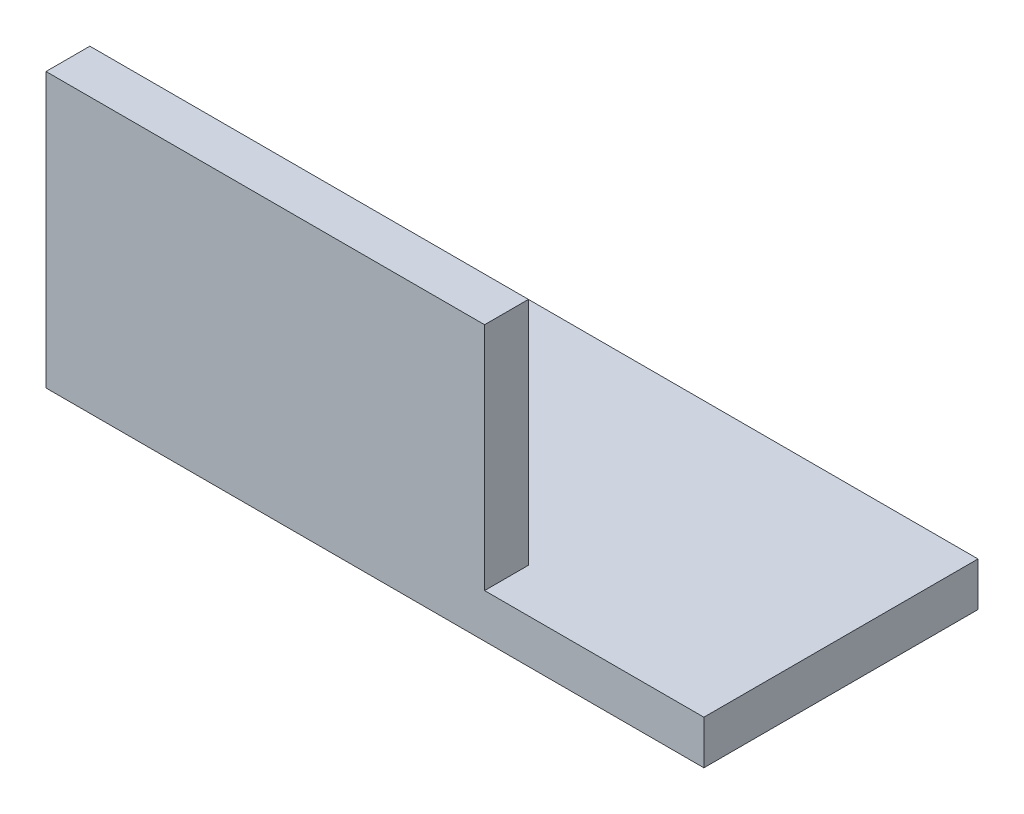
ISO-10303-21;
HEADER;
FILE_DESCRIPTION(('STEP AP214'),'2;1');
FILE_NAME('part.step','',(''),(''),'','','');
FILE_SCHEMA(('AUTOMOTIVE_DESIGN { 1 0 10303 214 1 1 1 1 }'));
ENDSEC;
DATA;
#1=APPLICATION_CONTEXT('core data for automotive mechanical design processes');
#2=APPLICATION_PROTOCOL_DEFINITION('international standard','automotive_design',2000,#1);
#3=PRODUCT_CONTEXT('',#1,'mechanical');
#4=PRODUCT('Part','Part','',(#3));
#5=PRODUCT_RELATED_PRODUCT_CATEGORY('part','',(#4));
#6=PRODUCT_DEFINITION_FORMATION('','',#4);
#7=PRODUCT_DEFINITION_CONTEXT('part definition',#1,'design');
#8=PRODUCT_DEFINITION('design','',#6,#7);
#9=PRODUCT_DEFINITION_SHAPE('','',#8);
#10=(LENGTH_UNIT() NAMED_UNIT(*) SI_UNIT(.MILLI.,.METRE.));
#11=(NAMED_UNIT(*) PLANE_ANGLE_UNIT() SI_UNIT($,.RADIAN.));
#12=(NAMED_UNIT(*) SI_UNIT($,.STERADIAN.) SOLID_ANGLE_UNIT());
#13=UNCERTAINTY_MEASURE_WITH_UNIT(LENGTH_MEASURE(1.E-05),#10,'distance_accuracy_value','');
#14=(GEOMETRIC_REPRESENTATION_CONTEXT(3) GLOBAL_UNCERTAINTY_ASSIGNED_CONTEXT((#13)) GLOBAL_UNIT_ASSIGNED_CONTEXT((#10,
#11,#12)) REPRESENTATION_CONTEXT('',''));
#15=CARTESIAN_POINT('',(0.,0.,0.));
#16=DIRECTION('',(0.,0.,1.));
#17=DIRECTION('',(1.,0.,0.));
#18=AXIS2_PLACEMENT_3D('',#15,#16,#17);
#19=CARTESIAN_POINT('',(60.,0.,-4.));
#20=DIRECTION('',(0.,0.,1.));
#21=DIRECTION('',(1.,0.,0.));
#22=AXIS2_PLACEMENT_3D('',#19,#20,#21);
#23=PLANE('',#22);
#24=DIRECTION('',(-1.,0.,0.));
#25=VECTOR('',#24,1.);
#26=CARTESIAN_POINT('',(60.,25.,-4.));
#27=LINE('',#26,#25);
#28=CARTESIAN_POINT('',(40.,25.,-4.));
#29=VERTEX_POINT('',#28);
#30=CARTESIAN_POINT('',(0.,25.,-4.));
#31=VERTEX_POINT('',#30);
#32=EDGE_CURVE('E11',#29,#31,#27,.T.);
#33=ORIENTED_EDGE('',*,*,#32,.F.);
#34=DIRECTION('',(0.,-1.,0.));
#35=VECTOR('',#34,1.);
#36=CARTESIAN_POINT('',(40.,0.,-4.));
#37=LINE('',#36,#35);
#38=CARTESIAN_POINT('',(40.,4.,-4.));
#39=VERTEX_POINT('',#38);
#40=EDGE_CURVE('E119',#29,#39,#37,.T.);
#41=ORIENTED_EDGE('',*,*,#40,.T.);
#42=DIRECTION('',(-1.,0.,0.));
#43=VECTOR('',#42,1.);
#44=CARTESIAN_POINT('',(60.,4.,-4.));
#45=LINE('',#44,#43);
#46=CARTESIAN_POINT('',(0.,4.,-4.));
#47=VERTEX_POINT('',#46);
#48=EDGE_CURVE('E82',#39,#47,#45,.T.);
#49=ORIENTED_EDGE('',*,*,#48,.T.);
#50=DIRECTION('',(0.,1.,0.));
#51=VECTOR('',#50,1.);
#52=CARTESIAN_POINT('',(0.,0.,-4.));
#53=LINE('',#52,#51);
#54=EDGE_CURVE('E122',#47,#31,#53,.T.);
#55=ORIENTED_EDGE('',*,*,#54,.T.);
#56=EDGE_LOOP('',(#33,#41,#49,#55));
#57=FACE_BOUND('',#56,.T.);
#58=ADVANCED_FACE('F34',(#57),#23,.F.);
#59=CARTESIAN_POINT('',(60.,25.,0.));
#60=DIRECTION('',(0.,1.,0.));
#61=DIRECTION('',(0.,0.,1.));
#62=AXIS2_PLACEMENT_3D('',#59,#60,#61);
#63=PLANE('',#62);
#64=DIRECTION('',(0.,0.,1.));
#65=VECTOR('',#64,1.);
#66=CARTESIAN_POINT('',(40.,25.,-25.));
#67=LINE('',#66,#65);
#68=CARTESIAN_POINT('',(40.,25.,0.));
#69=VERTEX_POINT('',#68);
#70=EDGE_CURVE('E107',#29,#69,#67,.T.);
#71=ORIENTED_EDGE('',*,*,#70,.F.);
#72=ORIENTED_EDGE('',*,*,#32,.T.);
#73=DIRECTION('',(0.,0.,-1.));
#74=VECTOR('',#73,1.);
#75=CARTESIAN_POINT('',(0.,25.,0.));
#76=LINE('',#75,#74);
#77=CARTESIAN_POINT('',(0.,25.,0.));
#78=VERTEX_POINT('',#77);
#79=EDGE_CURVE('E132',#78,#31,#76,.T.);
#80=ORIENTED_EDGE('',*,*,#79,.F.);
#81=DIRECTION('',(-1.,0.,0.));
#82=VECTOR('',#81,1.);
#83=CARTESIAN_POINT('',(60.,25.,0.));
#84=LINE('',#83,#82);
#85=EDGE_CURVE('E41',#69,#78,#84,.T.);
#86=ORIENTED_EDGE('',*,*,#85,.F.);
#87=EDGE_LOOP('',(#71,#72,#80,#86));
#88=FACE_BOUND('',#87,.T.);
#89=ADVANCED_FACE('F151',(#88),#63,.T.);
#90=CARTESIAN_POINT('',(60.,0.,0.));
#91=DIRECTION('',(0.,0.,1.));
#92=DIRECTION('',(1.,0.,0.));
#93=AXIS2_PLACEMENT_3D('',#90,#91,#92);
#94=PLANE('',#93);
#95=DIRECTION('',(0.,-1.,0.));
#96=VECTOR('',#95,1.);
#97=CARTESIAN_POINT('',(40.,25.,0.));
#98=LINE('',#97,#96);
#99=CARTESIAN_POINT('',(40.,4.,0.));
#100=VERTEX_POINT('',#99);
#101=EDGE_CURVE('E110',#69,#100,#98,.T.);
#102=ORIENTED_EDGE('',*,*,#101,.F.);
#103=ORIENTED_EDGE('',*,*,#85,.T.);
#104=DIRECTION('',(0.,1.,0.));
#105=VECTOR('',#104,1.);
#106=CARTESIAN_POINT('',(0.,0.,0.));
#107=LINE('',#106,#105);
#108=CARTESIAN_POINT('',(0.,0.,0.));
#109=VERTEX_POINT('',#108);
#110=EDGE_CURVE('E135',#109,#78,#107,.T.);
#111=ORIENTED_EDGE('',*,*,#110,.F.);
#112=DIRECTION('',(-1.,0.,0.));
#113=VECTOR('',#112,1.);
#114=CARTESIAN_POINT('',(60.,0.,0.));
#115=LINE('',#114,#113);
#116=CARTESIAN_POINT('',(60.,0.,0.));
#117=VERTEX_POINT('',#116);
#118=EDGE_CURVE('E88',#117,#109,#115,.T.);
#119=ORIENTED_EDGE('',*,*,#118,.F.);
#120=DIRECTION('',(0.,1.,0.));
#121=VECTOR('',#120,1.);
#122=CARTESIAN_POINT('',(60.,0.,0.));
#123=LINE('',#122,#121);
#124=CARTESIAN_POINT('',(60.,4.,0.));
#125=VERTEX_POINT('',#124);
#126=EDGE_CURVE('E116',#117,#125,#123,.T.);
#127=ORIENTED_EDGE('',*,*,#126,.T.);
#128=DIRECTION('',(1.,0.,0.));
#129=VECTOR('',#128,1.);
#130=CARTESIAN_POINT('',(40.,4.,0.));
#131=LINE('',#130,#129);
#132=EDGE_CURVE('E105',#100,#125,#131,.T.);
#133=ORIENTED_EDGE('',*,*,#132,.F.);
#134=EDGE_LOOP('',(#102,#103,#111,#119,#127,#133));
#135=FACE_BOUND('',#134,.T.);
#136=ADVANCED_FACE('F115',(#135),#94,.T.);
#137=CARTESIAN_POINT('',(60.,0.,0.));
#138=DIRECTION('',(0.,-1.,0.));
#139=DIRECTION('',(0.,0.,-1.));
#140=AXIS2_PLACEMENT_3D('',#137,#138,#139);
#141=PLANE('',#140);
#142=DIRECTION('',(0.,0.,1.));
#143=VECTOR('',#142,1.);
#144=CARTESIAN_POINT('',(0.,0.,0.));
#145=LINE('',#144,#143);
#146=CARTESIAN_POINT('',(0.,0.,-25.));
#147=VERTEX_POINT('',#146);
#148=EDGE_CURVE('E138',#147,#109,#145,.T.);
#149=ORIENTED_EDGE('',*,*,#148,.F.);
#150=DIRECTION('',(-1.,0.,0.));
#151=VECTOR('',#150,1.);
#152=CARTESIAN_POINT('',(60.,0.,-25.));
#153=LINE('',#152,#151);
#154=CARTESIAN_POINT('',(60.,0.,-25.));
#155=VERTEX_POINT('',#154);
#156=EDGE_CURVE('E147',#155,#147,#153,.T.);
#157=ORIENTED_EDGE('',*,*,#156,.F.);
#158=DIRECTION('',(0.,0.,1.));
#159=VECTOR('',#158,1.);
#160=CARTESIAN_POINT('',(60.,0.,0.));
#161=LINE('',#160,#159);
#162=EDGE_CURVE('E124',#155,#117,#161,.T.);
#163=ORIENTED_EDGE('',*,*,#162,.T.);
#164=ORIENTED_EDGE('',*,*,#118,.T.);
#165=EDGE_LOOP('',(#149,#157,#163,#164));
#166=FACE_BOUND('',#165,.T.);
#167=ADVANCED_FACE('F159',(#166),#141,.T.);
#168=CARTESIAN_POINT('',(60.,4.,-25.));
#169=DIRECTION('',(0.,0.,-1.));
#170=DIRECTION('',(-1.,0.,0.));
#171=AXIS2_PLACEMENT_3D('',#168,#169,#170);
#172=PLANE('',#171);
#173=DIRECTION('',(0.,-1.,0.));
#174=VECTOR('',#173,1.);
#175=CARTESIAN_POINT('',(0.,4.,-25.));
#176=LINE('',#175,#174);
#177=CARTESIAN_POINT('',(0.,4.,-25.));
#178=VERTEX_POINT('',#177);
#179=EDGE_CURVE('E141',#178,#147,#176,.T.);
#180=ORIENTED_EDGE('',*,*,#179,.F.);
#181=DIRECTION('',(-1.,0.,0.));
#182=VECTOR('',#181,1.);
#183=CARTESIAN_POINT('',(60.,4.,-25.));
#184=LINE('',#183,#182);
#185=CARTESIAN_POINT('',(60.,4.,-25.));
#186=VERTEX_POINT('',#185);
#187=EDGE_CURVE('E57',#186,#178,#184,.T.);
#188=ORIENTED_EDGE('',*,*,#187,.F.);
#189=DIRECTION('',(0.,-1.,0.));
#190=VECTOR('',#189,1.);
#191=CARTESIAN_POINT('',(60.,4.,-25.));
#192=LINE('',#191,#190);
#193=EDGE_CURVE('E128',#186,#155,#192,.T.);
#194=ORIENTED_EDGE('',*,*,#193,.T.);
#195=ORIENTED_EDGE('',*,*,#156,.T.);
#196=EDGE_LOOP('',(#180,#188,#194,#195));
#197=FACE_BOUND('',#196,.T.);
#198=ADVANCED_FACE('F162',(#197),#172,.T.);
#199=CARTESIAN_POINT('',(60.,4.,0.));
#200=DIRECTION('',(0.,-1.,0.));
#201=DIRECTION('',(0.,0.,-1.));
#202=AXIS2_PLACEMENT_3D('',#199,#200,#201);
#203=PLANE('',#202);
#204=ORIENTED_EDGE('',*,*,#48,.F.);
#205=DIRECTION('',(0.,0.,1.));
#206=VECTOR('',#205,1.);
#207=CARTESIAN_POINT('',(40.,4.,-25.));
#208=LINE('',#207,#206);
#209=EDGE_CURVE('E101',#39,#100,#208,.T.);
#210=ORIENTED_EDGE('',*,*,#209,.T.);
#211=ORIENTED_EDGE('',*,*,#132,.T.);
#212=DIRECTION('',(0.,0.,-1.));
#213=VECTOR('',#212,1.);
#214=CARTESIAN_POINT('',(60.,4.,0.));
#215=LINE('',#214,#213);
#216=EDGE_CURVE('E48',#186,#125,#215,.F.);
#217=ORIENTED_EDGE('',*,*,#216,.F.);
#218=ORIENTED_EDGE('',*,*,#187,.T.);
#219=DIRECTION('',(0.,0.,-1.));
#220=VECTOR('',#219,1.);
#221=CARTESIAN_POINT('',(0.,4.,0.));
#222=LINE('',#221,#220);
#223=EDGE_CURVE('E125',#178,#47,#222,.F.);
#224=ORIENTED_EDGE('',*,*,#223,.T.);
#225=EDGE_LOOP('',(#204,#210,#211,#217,#218,#224));
#226=FACE_BOUND('',#225,.T.);
#227=ADVANCED_FACE('F103',(#226),#203,.F.);
#228=CARTESIAN_POINT('',(60.,0.,0.));
#229=DIRECTION('',(-1.,0.,0.));
#230=DIRECTION('',(0.,0.,1.));
#231=AXIS2_PLACEMENT_3D('',#228,#229,#230);
#232=PLANE('',#231);
#233=ORIENTED_EDGE('',*,*,#216,.T.);
#234=ORIENTED_EDGE('',*,*,#126,.F.);
#235=ORIENTED_EDGE('',*,*,#162,.F.);
#236=ORIENTED_EDGE('',*,*,#193,.F.);
#237=EDGE_LOOP('',(#233,#234,#235,#236));
#238=FACE_BOUND('',#237,.T.);
#239=ADVANCED_FACE('F161',(#238),#232,.F.);
#240=CARTESIAN_POINT('',(0.,0.,0.));
#241=DIRECTION('',(-1.,0.,0.));
#242=DIRECTION('',(0.,0.,1.));
#243=AXIS2_PLACEMENT_3D('',#240,#241,#242);
#244=PLANE('',#243);
#245=ORIENTED_EDGE('',*,*,#54,.F.);
#246=ORIENTED_EDGE('',*,*,#223,.F.);
#247=ORIENTED_EDGE('',*,*,#179,.T.);
#248=ORIENTED_EDGE('',*,*,#148,.T.);
#249=ORIENTED_EDGE('',*,*,#110,.T.);
#250=ORIENTED_EDGE('',*,*,#79,.T.);
#251=EDGE_LOOP('',(#245,#246,#247,#248,#249,#250));
#252=FACE_BOUND('',#251,.T.);
#253=ADVANCED_FACE('F155',(#252),#244,.T.);
#254=CARTESIAN_POINT('',(40.,25.,-25.));
#255=DIRECTION('',(-1.,0.,0.));
#256=DIRECTION('',(0.,-1.,0.));
#257=AXIS2_PLACEMENT_3D('',#254,#255,#256);
#258=PLANE('',#257);
#259=ORIENTED_EDGE('',*,*,#70,.T.);
#260=ORIENTED_EDGE('',*,*,#101,.T.);
#261=ORIENTED_EDGE('',*,*,#209,.F.);
#262=ORIENTED_EDGE('',*,*,#40,.F.);
#263=EDGE_LOOP('',(#259,#260,#261,#262));
#264=FACE_BOUND('',#263,.T.);
#265=ADVANCED_FACE('F111',(#264),#258,.F.);
#266=CLOSED_SHELL('',(#58,#89,#136,#167,#198,#227,#239,#253,#265));
#267=MANIFOLD_SOLID_BREP('B2',#266);
#268=ADVANCED_BREP_SHAPE_REPRESENTATION('',(#18,#267),#14);
#269=SHAPE_DEFINITION_REPRESENTATION(#9,#268);
ENDSEC;
END-ISO-10303-21;
